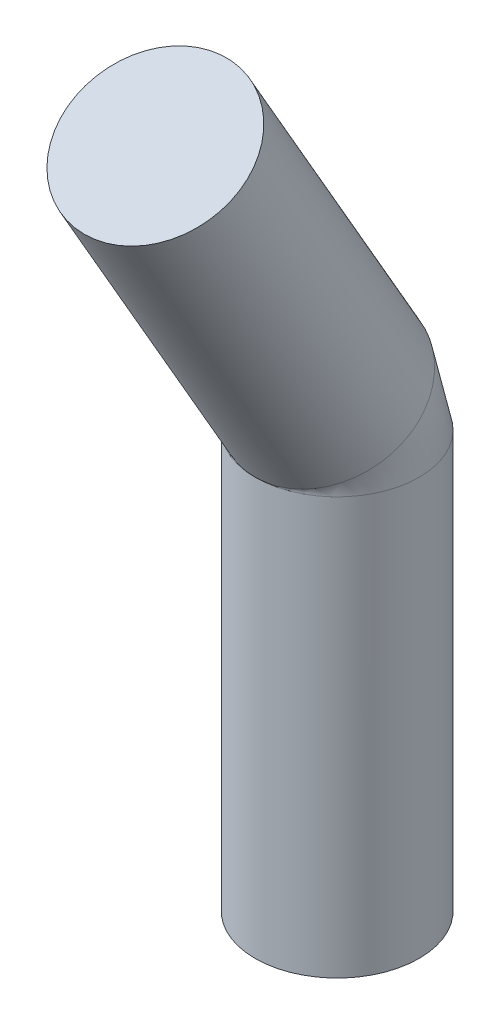
ISO-10303-21;
HEADER;
FILE_DESCRIPTION(('STEP AP214'),'2;1');
FILE_NAME('part.step','',(''),(''),'','','');
FILE_SCHEMA(('AUTOMOTIVE_DESIGN { 1 0 10303 214 1 1 1 1 }'));
ENDSEC;
DATA;
#1=APPLICATION_CONTEXT('core data for automotive mechanical design processes');
#2=APPLICATION_PROTOCOL_DEFINITION('international standard','automotive_design',2000,#1);
#3=PRODUCT_CONTEXT('',#1,'mechanical');
#4=PRODUCT('Part','Part','',(#3));
#5=PRODUCT_RELATED_PRODUCT_CATEGORY('part','',(#4));
#6=PRODUCT_DEFINITION_FORMATION('','',#4);
#7=PRODUCT_DEFINITION_CONTEXT('part definition',#1,'design');
#8=PRODUCT_DEFINITION('design','',#6,#7);
#9=PRODUCT_DEFINITION_SHAPE('','',#8);
#10=(LENGTH_UNIT() NAMED_UNIT(*) SI_UNIT(.MILLI.,.METRE.));
#11=(NAMED_UNIT(*) PLANE_ANGLE_UNIT() SI_UNIT($,.RADIAN.));
#12=(NAMED_UNIT(*) SI_UNIT($,.STERADIAN.) SOLID_ANGLE_UNIT());
#13=UNCERTAINTY_MEASURE_WITH_UNIT(LENGTH_MEASURE(1.E-05),#10,'distance_accuracy_value','');
#14=(GEOMETRIC_REPRESENTATION_CONTEXT(3) GLOBAL_UNCERTAINTY_ASSIGNED_CONTEXT((#13)) GLOBAL_UNIT_ASSIGNED_CONTEXT((#10,
#11,#12)) REPRESENTATION_CONTEXT('',''));
#15=CARTESIAN_POINT('',(0.,0.,0.));
#16=DIRECTION('',(0.,0.,1.));
#17=DIRECTION('',(1.,0.,0.));
#18=AXIS2_PLACEMENT_3D('',#15,#16,#17);
#19=CARTESIAN_POINT('',(0.,2.9650635094611,1.33038475772934));
#20=DIRECTION('',(0.,0.866025403784438,0.500000000000001));
#21=DIRECTION('',(0.,-0.500000000000001,0.866025403784438));
#22=AXIS2_PLACEMENT_3D('',#19,#20,#21);
#23=PLANE('',#22);
#24=CARTESIAN_POINT('',(0.,2.9650635094611,1.33038475772934));
#25=DIRECTION('',(0.,0.866025403784438,0.500000000000001));
#26=DIRECTION('',(0.,-0.500000000000001,0.866025403784438));
#27=AXIS2_PLACEMENT_3D('',#24,#25,#26);
#28=CIRCLE('',#27,0.6);
#29=CARTESIAN_POINT('',(0.,2.66506350946109,1.85));
#30=VERTEX_POINT('',#29);
#31=EDGE_CURVE('E11',#30,#30,#28,.T.);
#32=ORIENTED_EDGE('',*,*,#31,.T.);
#33=EDGE_LOOP('',(#32));
#34=FACE_BOUND('',#33,.T.);
#35=ADVANCED_FACE('F39',(#34),#23,.T.);
#36=CARTESIAN_POINT('',(0.,0.,0.));
#37=DIRECTION('',(0.,1.,0.));
#38=DIRECTION('',(0.,0.,1.));
#39=AXIS2_PLACEMENT_3D('',#36,#37,#38);
#40=CYLINDRICAL_SURFACE('',#39,0.6);
#41=CARTESIAN_POINT('',(0.,0.5,0.));
#42=DIRECTION('',(0.,1.,0.));
#43=DIRECTION('',(0.,0.,1.));
#44=AXIS2_PLACEMENT_3D('',#41,#42,#43);
#45=CIRCLE('',#44,0.6);
#46=CARTESIAN_POINT('',(0.,0.5,0.6));
#47=VERTEX_POINT('',#46);
#48=EDGE_CURVE('E50',#47,#47,#45,.T.);
#49=ORIENTED_EDGE('',*,*,#48,.F.);
#50=EDGE_LOOP('',(#49));
#51=FACE_BOUND('',#50,.T.);
#52=CARTESIAN_POINT('',(0.,-2.55,0.));
#53=DIRECTION('',(0.,-1.,0.));
#54=DIRECTION('',(0.,0.,-1.));
#55=AXIS2_PLACEMENT_3D('',#52,#53,#54);
#56=CIRCLE('',#55,0.6);
#57=CARTESIAN_POINT('',(0.,-2.55,-0.6));
#58=VERTEX_POINT('',#57);
#59=EDGE_CURVE('E57',#58,#58,#56,.T.);
#60=ORIENTED_EDGE('',*,*,#59,.F.);
#61=EDGE_LOOP('',(#60));
#62=FACE_BOUND('',#61,.T.);
#63=ADVANCED_FACE('F51',(#51,#62),#40,.T.);
#64=CARTESIAN_POINT('',(0.,0.5,0.6));
#65=DIRECTION('',(1.,0.,0.));
#66=DIRECTION('',(0.,0.,-1.));
#67=AXIS2_PLACEMENT_3D('',#64,#65,#66);
#68=DEGENERATE_TOROIDAL_SURFACE('',#67,0.6,0.6,.T.);
#69=CARTESIAN_POINT('',(0.,0.800000000000001,0.0803847577293372));
#70=DIRECTION('',(0.,0.866025403784438,0.500000000000001));
#71=DIRECTION('',(0.,-0.500000000000001,0.866025403784438));
#72=AXIS2_PLACEMENT_3D('',#69,#70,#71);
#73=CIRCLE('',#72,0.6);
#74=EDGE_CURVE('E46',#47,#47,#73,.T.);
#75=ORIENTED_EDGE('',*,*,#74,.F.);
#76=ORIENTED_EDGE('',*,*,#48,.T.);
#77=EDGE_LOOP('',(#75,#76));
#78=FACE_BOUND('',#77,.T.);
#79=ADVANCED_FACE('F67',(#78),#68,.T.);
#80=CARTESIAN_POINT('',(0.,0.800000000000001,0.0803847577293372));
#81=DIRECTION('',(0.,0.866025403784438,0.500000000000001));
#82=DIRECTION('',(0.,-0.500000000000001,0.866025403784438));
#83=AXIS2_PLACEMENT_3D('',#80,#81,#82);
#84=CYLINDRICAL_SURFACE('',#83,0.6);
#85=ORIENTED_EDGE('',*,*,#31,.F.);
#86=EDGE_LOOP('',(#85));
#87=FACE_BOUND('',#86,.T.);
#88=ORIENTED_EDGE('',*,*,#74,.T.);
#89=EDGE_LOOP('',(#88));
#90=FACE_BOUND('',#89,.T.);
#91=ADVANCED_FACE('F73',(#87,#90),#84,.T.);
#92=CARTESIAN_POINT('',(0.,-2.55,0.));
#93=DIRECTION('',(0.,-1.,0.));
#94=DIRECTION('',(0.,0.,-1.));
#95=AXIS2_PLACEMENT_3D('',#92,#93,#94);
#96=PLANE('',#95);
#97=ORIENTED_EDGE('',*,*,#59,.T.);
#98=EDGE_LOOP('',(#97));
#99=FACE_BOUND('',#98,.T.);
#100=ADVANCED_FACE('F65',(#99),#96,.T.);
#101=CLOSED_SHELL('',(#35,#63,#79,#91,#100));
#102=MANIFOLD_SOLID_BREP('B2',#101);
#103=ADVANCED_BREP_SHAPE_REPRESENTATION('',(#18,#102),#14);
#104=SHAPE_DEFINITION_REPRESENTATION(#9,#103);
ENDSEC;
END-ISO-10303-21;
